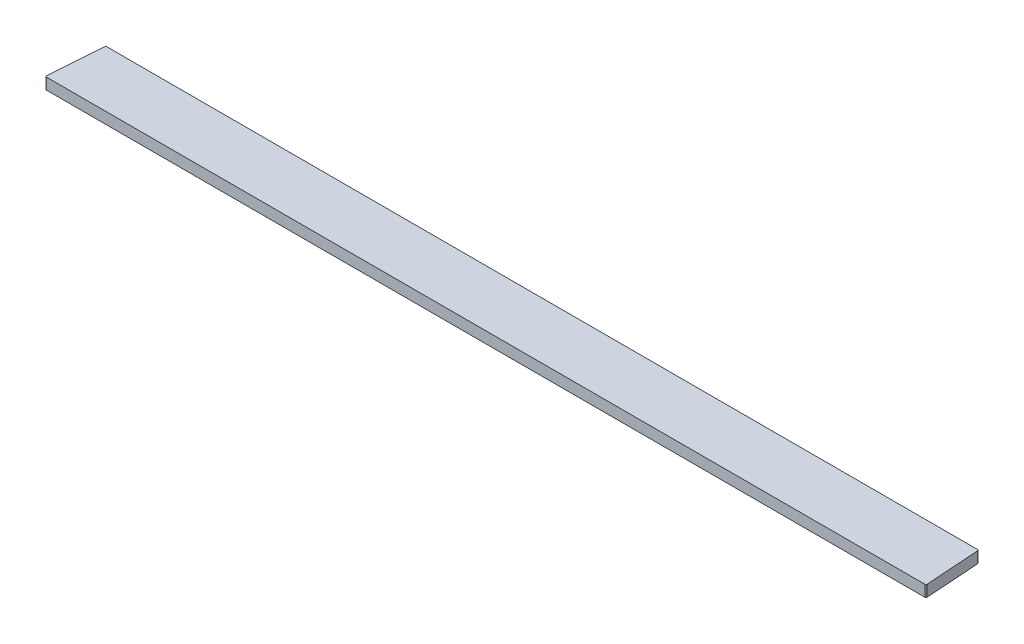
ISO-10303-21;
HEADER;
FILE_DESCRIPTION(('STEP AP214'),'2;1');
FILE_NAME('part.step','',(''),(''),'','','');
FILE_SCHEMA(('AUTOMOTIVE_DESIGN { 1 0 10303 214 1 1 1 1 }'));
ENDSEC;
DATA;
#1=APPLICATION_CONTEXT('core data for automotive mechanical design processes');
#2=APPLICATION_PROTOCOL_DEFINITION('international standard','automotive_design',2000,#1);
#3=PRODUCT_CONTEXT('',#1,'mechanical');
#4=PRODUCT('Part','Part','',(#3));
#5=PRODUCT_RELATED_PRODUCT_CATEGORY('part','',(#4));
#6=PRODUCT_DEFINITION_FORMATION('','',#4);
#7=PRODUCT_DEFINITION_CONTEXT('part definition',#1,'design');
#8=PRODUCT_DEFINITION('design','',#6,#7);
#9=PRODUCT_DEFINITION_SHAPE('','',#8);
#10=(LENGTH_UNIT() NAMED_UNIT(*) SI_UNIT(.MILLI.,.METRE.));
#11=(NAMED_UNIT(*) PLANE_ANGLE_UNIT() SI_UNIT($,.RADIAN.));
#12=(NAMED_UNIT(*) SI_UNIT($,.STERADIAN.) SOLID_ANGLE_UNIT());
#13=UNCERTAINTY_MEASURE_WITH_UNIT(LENGTH_MEASURE(1.E-05),#10,'distance_accuracy_value','');
#14=(GEOMETRIC_REPRESENTATION_CONTEXT(3) GLOBAL_UNCERTAINTY_ASSIGNED_CONTEXT((#13)) GLOBAL_UNIT_ASSIGNED_CONTEXT((#10,
#11,#12)) REPRESENTATION_CONTEXT('',''));
#15=CARTESIAN_POINT('',(0.,0.,0.));
#16=DIRECTION('',(0.,0.,1.));
#17=DIRECTION('',(1.,0.,0.));
#18=AXIS2_PLACEMENT_3D('',#15,#16,#17);
#19=CARTESIAN_POINT('',(-386.503659402824,-10.,-50.));
#20=DIRECTION('',(-0.997564050259824,0.,-0.0697564737441285));
#21=DIRECTION('',(-0.0697564737441285,0.,0.997564050259824));
#22=AXIS2_PLACEMENT_3D('',#19,#20,#21);
#23=PLANE('',#22);
#24=DIRECTION('',(-0.0697564737441285,0.,0.997564050259824));
#25=VECTOR('',#24,1.);
#26=CARTESIAN_POINT('',(-386.503659402824,0.,-50.));
#27=LINE('',#26,#25);
#28=CARTESIAN_POINT('',(-386.568708366947,0.,-49.0697564737441));
#29=VERTEX_POINT('',#28);
#30=CARTESIAN_POINT('',(-389.925195340235,0.,-1.06975647374412));
#31=VERTEX_POINT('',#30);
#32=EDGE_CURVE('E107',#29,#31,#27,.T.);
#33=ORIENTED_EDGE('',*,*,#32,.F.);
#34=DIRECTION('',(0.,1.,0.));
#35=VECTOR('',#34,1.);
#36=CARTESIAN_POINT('',(-386.568708366947,-10.,-49.0697564737441));
#37=LINE('',#36,#35);
#38=CARTESIAN_POINT('',(-386.568708366947,-10.,-49.0697564737441));
#39=VERTEX_POINT('',#38);
#40=EDGE_CURVE('E11',#29,#39,#37,.F.);
#41=ORIENTED_EDGE('',*,*,#40,.T.);
#42=DIRECTION('',(-0.0697564737441285,0.,0.997564050259824));
#43=VECTOR('',#42,1.);
#44=CARTESIAN_POINT('',(-386.503659402824,-10.,-50.));
#45=LINE('',#44,#43);
#46=CARTESIAN_POINT('',(-389.925195340235,-10.,-1.06975647374412));
#47=VERTEX_POINT('',#46);
#48=EDGE_CURVE('E157',#39,#47,#45,.T.);
#49=ORIENTED_EDGE('',*,*,#48,.T.);
#50=DIRECTION('',(0.,1.,0.));
#51=VECTOR('',#50,1.);
#52=CARTESIAN_POINT('',(-389.925195340235,-10.,-1.06975647374413));
#53=LINE('',#52,#51);
#54=EDGE_CURVE('E44',#47,#31,#53,.T.);
#55=ORIENTED_EDGE('',*,*,#54,.T.);
#56=EDGE_LOOP('',(#33,#41,#49,#55));
#57=FACE_BOUND('',#56,.T.);
#58=ADVANCED_FACE('F36',(#57),#23,.T.);
#59=CARTESIAN_POINT('',(-386.503659402824,-10.,-50.));
#60=DIRECTION('',(0.,0.,-1.));
#61=DIRECTION('',(-1.,0.,0.));
#62=AXIS2_PLACEMENT_3D('',#59,#60,#61);
#63=PLANE('',#62);
#64=DIRECTION('',(-1.,0.,0.));
#65=VECTOR('',#64,1.);
#66=CARTESIAN_POINT('',(-386.503659402824,0.,-50.));
#67=LINE('',#66,#65);
#68=CARTESIAN_POINT('',(385.571144316687,0.,-50.));
#69=VERTEX_POINT('',#68);
#70=CARTESIAN_POINT('',(-385.571144316687,0.,-50.));
#71=VERTEX_POINT('',#70);
#72=EDGE_CURVE('E132',#69,#71,#67,.T.);
#73=ORIENTED_EDGE('',*,*,#72,.F.);
#74=DIRECTION('',(0.,1.,0.));
#75=VECTOR('',#74,1.);
#76=CARTESIAN_POINT('',(385.571144316687,-10.,-50.));
#77=LINE('',#76,#75);
#78=CARTESIAN_POINT('',(385.571144316687,-10.,-50.));
#79=VERTEX_POINT('',#78);
#80=EDGE_CURVE('E58',#69,#79,#77,.F.);
#81=ORIENTED_EDGE('',*,*,#80,.T.);
#82=DIRECTION('',(-1.,0.,0.));
#83=VECTOR('',#82,1.);
#84=CARTESIAN_POINT('',(-386.503659402824,-10.,-50.));
#85=LINE('',#84,#83);
#86=CARTESIAN_POINT('',(-385.571144316687,-10.,-50.));
#87=VERTEX_POINT('',#86);
#88=EDGE_CURVE('E126',#79,#87,#85,.T.);
#89=ORIENTED_EDGE('',*,*,#88,.T.);
#90=DIRECTION('',(0.,1.,0.));
#91=VECTOR('',#90,1.);
#92=CARTESIAN_POINT('',(-385.571144316687,-10.,-50.));
#93=LINE('',#92,#91);
#94=EDGE_CURVE('E151',#87,#71,#93,.T.);
#95=ORIENTED_EDGE('',*,*,#94,.T.);
#96=EDGE_LOOP('',(#73,#81,#89,#95));
#97=FACE_BOUND('',#96,.T.);
#98=ADVANCED_FACE('F189',(#97),#63,.T.);
#99=CARTESIAN_POINT('',(386.503659402824,-10.,-50.));
#100=DIRECTION('',(0.997564050259824,0.,-0.0697564737441285));
#101=DIRECTION('',(-0.0697564737441285,0.,-0.997564050259824));
#102=AXIS2_PLACEMENT_3D('',#99,#100,#101);
#103=PLANE('',#102);
#104=DIRECTION('',(-0.0697564737441285,0.,-0.997564050259824));
#105=VECTOR('',#104,1.);
#106=CARTESIAN_POINT('',(386.503659402824,0.,-50.));
#107=LINE('',#106,#105);
#108=CARTESIAN_POINT('',(389.925195340235,0.,-1.06975647374411));
#109=VERTEX_POINT('',#108);
#110=CARTESIAN_POINT('',(386.568708366947,0.,-49.0697564737441));
#111=VERTEX_POINT('',#110);
#112=EDGE_CURVE('E122',#109,#111,#107,.T.);
#113=ORIENTED_EDGE('',*,*,#112,.F.);
#114=DIRECTION('',(0.,1.,0.));
#115=VECTOR('',#114,1.);
#116=CARTESIAN_POINT('',(389.925195340235,-10.,-1.06975647374412));
#117=LINE('',#116,#115);
#118=CARTESIAN_POINT('',(389.925195340235,-10.,-1.06975647374411));
#119=VERTEX_POINT('',#118);
#120=EDGE_CURVE('E143',#109,#119,#117,.F.);
#121=ORIENTED_EDGE('',*,*,#120,.T.);
#122=DIRECTION('',(-0.0697564737441285,0.,-0.997564050259824));
#123=VECTOR('',#122,1.);
#124=CARTESIAN_POINT('',(386.503659402824,-10.,-50.));
#125=LINE('',#124,#123);
#126=CARTESIAN_POINT('',(386.568708366947,-10.,-49.0697564737441));
#127=VERTEX_POINT('',#126);
#128=EDGE_CURVE('E129',#119,#127,#125,.T.);
#129=ORIENTED_EDGE('',*,*,#128,.T.);
#130=DIRECTION('',(0.,1.,0.));
#131=VECTOR('',#130,1.);
#132=CARTESIAN_POINT('',(386.568708366947,-10.,-49.0697564737441));
#133=LINE('',#132,#131);
#134=EDGE_CURVE('E140',#127,#111,#133,.T.);
#135=ORIENTED_EDGE('',*,*,#134,.T.);
#136=EDGE_LOOP('',(#113,#121,#129,#135));
#137=FACE_BOUND('',#136,.T.);
#138=ADVANCED_FACE('F169',(#137),#103,.T.);
#139=CARTESIAN_POINT('',(-390.,-10.,0.));
#140=DIRECTION('',(0.,0.,1.));
#141=DIRECTION('',(1.,0.,0.));
#142=AXIS2_PLACEMENT_3D('',#139,#140,#141);
#143=PLANE('',#142);
#144=DIRECTION('',(1.,0.,0.));
#145=VECTOR('',#144,1.);
#146=CARTESIAN_POINT('',(-390.,-10.,0.));
#147=LINE('',#146,#145);
#148=CARTESIAN_POINT('',(-388.927631289975,-10.,0.));
#149=VERTEX_POINT('',#148);
#150=CARTESIAN_POINT('',(388.927631289975,-10.,0.));
#151=VERTEX_POINT('',#150);
#152=EDGE_CURVE('E158',#149,#151,#147,.T.);
#153=ORIENTED_EDGE('',*,*,#152,.T.);
#154=DIRECTION('',(0.,1.,0.));
#155=VECTOR('',#154,1.);
#156=CARTESIAN_POINT('',(388.927631289975,-10.,0.));
#157=LINE('',#156,#155);
#158=CARTESIAN_POINT('',(388.927631289975,0.,0.));
#159=VERTEX_POINT('',#158);
#160=EDGE_CURVE('E113',#151,#159,#157,.T.);
#161=ORIENTED_EDGE('',*,*,#160,.T.);
#162=DIRECTION('',(1.,0.,0.));
#163=VECTOR('',#162,1.);
#164=CARTESIAN_POINT('',(-390.,0.,0.));
#165=LINE('',#164,#163);
#166=CARTESIAN_POINT('',(-388.927631289975,0.,0.));
#167=VERTEX_POINT('',#166);
#168=EDGE_CURVE('E105',#167,#159,#165,.T.);
#169=ORIENTED_EDGE('',*,*,#168,.F.);
#170=DIRECTION('',(0.,1.,0.));
#171=VECTOR('',#170,1.);
#172=CARTESIAN_POINT('',(-388.927631289975,-10.,0.));
#173=LINE('',#172,#171);
#174=EDGE_CURVE('E119',#167,#149,#173,.F.);
#175=ORIENTED_EDGE('',*,*,#174,.T.);
#176=EDGE_LOOP('',(#153,#161,#169,#175));
#177=FACE_BOUND('',#176,.T.);
#178=ADVANCED_FACE('F118',(#177),#143,.T.);
#179=CARTESIAN_POINT('',(0.,-10.,0.));
#180=DIRECTION('',(0.,1.,0.));
#181=DIRECTION('',(0.,0.,1.));
#182=AXIS2_PLACEMENT_3D('',#179,#180,#181);
#183=PLANE('',#182);
#184=ORIENTED_EDGE('',*,*,#128,.F.);
#185=CARTESIAN_POINT('',(388.927631289975,-10.,-1.));
#186=DIRECTION('',(0.,1.,0.));
#187=DIRECTION('',(0.,0.,1.));
#188=AXIS2_PLACEMENT_3D('',#185,#186,#187);
#189=CIRCLE('',#188,1.);
#190=EDGE_CURVE('E149',#119,#151,#189,.F.);
#191=ORIENTED_EDGE('',*,*,#190,.T.);
#192=ORIENTED_EDGE('',*,*,#152,.F.);
#193=CARTESIAN_POINT('',(-388.927631289975,-10.,-1.));
#194=DIRECTION('',(0.,1.,0.));
#195=DIRECTION('',(0.,0.,1.));
#196=AXIS2_PLACEMENT_3D('',#193,#194,#195);
#197=CIRCLE('',#196,1.);
#198=EDGE_CURVE('E125',#149,#47,#197,.F.);
#199=ORIENTED_EDGE('',*,*,#198,.T.);
#200=ORIENTED_EDGE('',*,*,#48,.F.);
#201=CARTESIAN_POINT('',(-385.571144316687,-10.,-49.));
#202=DIRECTION('',(0.,1.,0.));
#203=DIRECTION('',(0.,0.,1.));
#204=AXIS2_PLACEMENT_3D('',#201,#202,#203);
#205=CIRCLE('',#204,1.);
#206=EDGE_CURVE('E51',#39,#87,#205,.F.);
#207=ORIENTED_EDGE('',*,*,#206,.T.);
#208=ORIENTED_EDGE('',*,*,#88,.F.);
#209=CARTESIAN_POINT('',(385.571144316687,-10.,-49.));
#210=DIRECTION('',(0.,1.,0.));
#211=DIRECTION('',(0.,0.,1.));
#212=AXIS2_PLACEMENT_3D('',#209,#210,#211);
#213=CIRCLE('',#212,1.);
#214=EDGE_CURVE('E147',#79,#127,#213,.F.);
#215=ORIENTED_EDGE('',*,*,#214,.T.);
#216=EDGE_LOOP('',(#184,#191,#192,#199,#200,#207,#208,#215));
#217=FACE_BOUND('',#216,.T.);
#218=ADVANCED_FACE('F175',(#217),#183,.F.);
#219=CARTESIAN_POINT('',(0.,0.,0.));
#220=DIRECTION('',(0.,1.,0.));
#221=DIRECTION('',(0.,0.,1.));
#222=AXIS2_PLACEMENT_3D('',#219,#220,#221);
#223=PLANE('',#222);
#224=ORIENTED_EDGE('',*,*,#168,.T.);
#225=CARTESIAN_POINT('',(388.927631289975,0.,-1.));
#226=DIRECTION('',(0.,1.,0.));
#227=DIRECTION('',(0.,0.,1.));
#228=AXIS2_PLACEMENT_3D('',#225,#226,#227);
#229=CIRCLE('',#228,1.);
#230=EDGE_CURVE('E138',#159,#109,#229,.T.);
#231=ORIENTED_EDGE('',*,*,#230,.T.);
#232=ORIENTED_EDGE('',*,*,#112,.T.);
#233=CARTESIAN_POINT('',(385.571144316687,0.,-49.));
#234=DIRECTION('',(0.,1.,0.));
#235=DIRECTION('',(0.,0.,1.));
#236=AXIS2_PLACEMENT_3D('',#233,#234,#235);
#237=CIRCLE('',#236,1.);
#238=EDGE_CURVE('E136',#111,#69,#237,.T.);
#239=ORIENTED_EDGE('',*,*,#238,.T.);
#240=ORIENTED_EDGE('',*,*,#72,.T.);
#241=CARTESIAN_POINT('',(-385.571144316687,0.,-49.));
#242=DIRECTION('',(0.,1.,0.));
#243=DIRECTION('',(0.,0.,1.));
#244=AXIS2_PLACEMENT_3D('',#241,#242,#243);
#245=CIRCLE('',#244,1.);
#246=EDGE_CURVE('E112',#71,#29,#245,.T.);
#247=ORIENTED_EDGE('',*,*,#246,.T.);
#248=ORIENTED_EDGE('',*,*,#32,.T.);
#249=CARTESIAN_POINT('',(-388.927631289975,0.,-1.));
#250=DIRECTION('',(0.,1.,0.));
#251=DIRECTION('',(0.,0.,1.));
#252=AXIS2_PLACEMENT_3D('',#249,#250,#251);
#253=CIRCLE('',#252,1.);
#254=EDGE_CURVE('E102',#31,#167,#253,.T.);
#255=ORIENTED_EDGE('',*,*,#254,.T.);
#256=EDGE_LOOP('',(#224,#231,#232,#239,#240,#247,#248,#255));
#257=FACE_BOUND('',#256,.T.);
#258=ADVANCED_FACE('F104',(#257),#223,.T.);
#259=CARTESIAN_POINT('',(388.927631289975,-10.,-1.));
#260=DIRECTION('',(0.,1.,0.));
#261=DIRECTION('',(0.,0.,1.));
#262=AXIS2_PLACEMENT_3D('',#259,#260,#261);
#263=CYLINDRICAL_SURFACE('',#262,1.);
#264=ORIENTED_EDGE('',*,*,#190,.F.);
#265=ORIENTED_EDGE('',*,*,#120,.F.);
#266=ORIENTED_EDGE('',*,*,#230,.F.);
#267=ORIENTED_EDGE('',*,*,#160,.F.);
#268=EDGE_LOOP('',(#264,#265,#266,#267));
#269=FACE_BOUND('',#268,.T.);
#270=ADVANCED_FACE('F174',(#269),#263,.T.);
#271=CARTESIAN_POINT('',(385.571144316687,-10.,-49.));
#272=DIRECTION('',(0.,1.,0.));
#273=DIRECTION('',(0.,0.,1.));
#274=AXIS2_PLACEMENT_3D('',#271,#272,#273);
#275=CYLINDRICAL_SURFACE('',#274,1.);
#276=ORIENTED_EDGE('',*,*,#214,.F.);
#277=ORIENTED_EDGE('',*,*,#80,.F.);
#278=ORIENTED_EDGE('',*,*,#238,.F.);
#279=ORIENTED_EDGE('',*,*,#134,.F.);
#280=EDGE_LOOP('',(#276,#277,#278,#279));
#281=FACE_BOUND('',#280,.T.);
#282=ADVANCED_FACE('F178',(#281),#275,.T.);
#283=CARTESIAN_POINT('',(-385.571144316687,-10.,-49.));
#284=DIRECTION('',(0.,1.,0.));
#285=DIRECTION('',(0.,0.,1.));
#286=AXIS2_PLACEMENT_3D('',#283,#284,#285);
#287=CYLINDRICAL_SURFACE('',#286,1.);
#288=ORIENTED_EDGE('',*,*,#206,.F.);
#289=ORIENTED_EDGE('',*,*,#40,.F.);
#290=ORIENTED_EDGE('',*,*,#246,.F.);
#291=ORIENTED_EDGE('',*,*,#94,.F.);
#292=EDGE_LOOP('',(#288,#289,#290,#291));
#293=FACE_BOUND('',#292,.T.);
#294=ADVANCED_FACE('F180',(#293),#287,.T.);
#295=CARTESIAN_POINT('',(-388.927631289975,-10.,-1.));
#296=DIRECTION('',(0.,1.,0.));
#297=DIRECTION('',(0.,0.,1.));
#298=AXIS2_PLACEMENT_3D('',#295,#296,#297);
#299=CYLINDRICAL_SURFACE('',#298,1.);
#300=ORIENTED_EDGE('',*,*,#198,.F.);
#301=ORIENTED_EDGE('',*,*,#174,.F.);
#302=ORIENTED_EDGE('',*,*,#254,.F.);
#303=ORIENTED_EDGE('',*,*,#54,.F.);
#304=EDGE_LOOP('',(#300,#301,#302,#303));
#305=FACE_BOUND('',#304,.T.);
#306=ADVANCED_FACE('F38',(#305),#299,.T.);
#307=CLOSED_SHELL('',(#58,#98,#138,#178,#218,#258,#270,#282,#294,#306));
#308=MANIFOLD_SOLID_BREP('B2',#307);
#309=ADVANCED_BREP_SHAPE_REPRESENTATION('',(#18,#308),#14);
#310=SHAPE_DEFINITION_REPRESENTATION(#9,#309);
ENDSEC;
END-ISO-10303-21;
